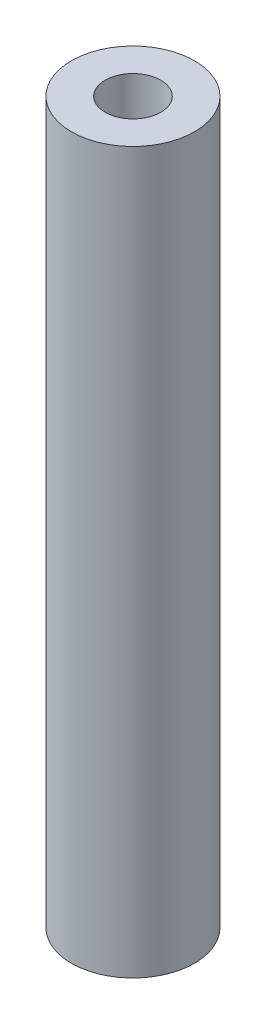
ISO-10303-21;
HEADER;
FILE_DESCRIPTION(('STEP AP214'),'2;1');
FILE_NAME('part.step','',(''),(''),'','','');
FILE_SCHEMA(('AUTOMOTIVE_DESIGN { 1 0 10303 214 1 1 1 1 }'));
ENDSEC;
DATA;
#1=APPLICATION_CONTEXT('core data for automotive mechanical design processes');
#2=APPLICATION_PROTOCOL_DEFINITION('international standard','automotive_design',2000,#1);
#3=PRODUCT_CONTEXT('',#1,'mechanical');
#4=PRODUCT('Part','Part','',(#3));
#5=PRODUCT_RELATED_PRODUCT_CATEGORY('part','',(#4));
#6=PRODUCT_DEFINITION_FORMATION('','',#4);
#7=PRODUCT_DEFINITION_CONTEXT('part definition',#1,'design');
#8=PRODUCT_DEFINITION('design','',#6,#7);
#9=PRODUCT_DEFINITION_SHAPE('','',#8);
#10=(LENGTH_UNIT() NAMED_UNIT(*) SI_UNIT(.MILLI.,.METRE.));
#11=(NAMED_UNIT(*) PLANE_ANGLE_UNIT() SI_UNIT($,.RADIAN.));
#12=(NAMED_UNIT(*) SI_UNIT($,.STERADIAN.) SOLID_ANGLE_UNIT());
#13=UNCERTAINTY_MEASURE_WITH_UNIT(LENGTH_MEASURE(1.E-05),#10,'distance_accuracy_value','');
#14=(GEOMETRIC_REPRESENTATION_CONTEXT(3) GLOBAL_UNCERTAINTY_ASSIGNED_CONTEXT((#13)) GLOBAL_UNIT_ASSIGNED_CONTEXT((#10,
#11,#12)) REPRESENTATION_CONTEXT('',''));
#15=CARTESIAN_POINT('',(0.,0.,0.));
#16=DIRECTION('',(0.,0.,1.));
#17=DIRECTION('',(1.,0.,0.));
#18=AXIS2_PLACEMENT_3D('',#15,#16,#17);
#19=CARTESIAN_POINT('',(0.,55.7276,0.));
#20=DIRECTION('',(0.,1.,0.));
#21=DIRECTION('',(0.,0.,1.));
#22=AXIS2_PLACEMENT_3D('',#19,#20,#21);
#23=PLANE('',#22);
#24=CARTESIAN_POINT('',(0.,55.7276,0.));
#25=DIRECTION('',(0.,1.,0.));
#26=DIRECTION('',(0.,0.,1.));
#27=AXIS2_PLACEMENT_3D('',#24,#25,#26);
#28=CIRCLE('',#27,4.7625);
#29=CARTESIAN_POINT('',(0.,55.7276,4.7625));
#30=VERTEX_POINT('',#29);
#31=EDGE_CURVE('E10',#30,#30,#28,.T.);
#32=ORIENTED_EDGE('',*,*,#31,.T.);
#33=EDGE_LOOP('',(#32));
#34=FACE_BOUND('',#33,.T.);
#35=CARTESIAN_POINT('',(0.,55.7276,0.));
#36=DIRECTION('',(0.,1.,0.));
#37=DIRECTION('',(0.,0.,1.));
#38=AXIS2_PLACEMENT_3D('',#35,#36,#37);
#39=CIRCLE('',#38,2.15265);
#40=CARTESIAN_POINT('',(0.,55.7276,2.15265));
#41=VERTEX_POINT('',#40);
#42=EDGE_CURVE('E42',#41,#41,#39,.T.);
#43=ORIENTED_EDGE('',*,*,#42,.F.);
#44=EDGE_LOOP('',(#43));
#45=FACE_BOUND('',#44,.T.);
#46=ADVANCED_FACE('F31',(#34,#45),#23,.T.);
#47=CARTESIAN_POINT('',(0.,0.,0.));
#48=DIRECTION('',(0.,1.,0.));
#49=DIRECTION('',(0.,0.,1.));
#50=AXIS2_PLACEMENT_3D('',#47,#48,#49);
#51=PLANE('',#50);
#52=CARTESIAN_POINT('',(0.,0.,0.));
#53=DIRECTION('',(0.,1.,0.));
#54=DIRECTION('',(0.,0.,1.));
#55=AXIS2_PLACEMENT_3D('',#52,#53,#54);
#56=CIRCLE('',#55,4.7625);
#57=CARTESIAN_POINT('',(0.,0.,4.7625));
#58=VERTEX_POINT('',#57);
#59=EDGE_CURVE('E35',#58,#58,#56,.T.);
#60=ORIENTED_EDGE('',*,*,#59,.F.);
#61=EDGE_LOOP('',(#60));
#62=FACE_BOUND('',#61,.T.);
#63=CARTESIAN_POINT('',(0.,0.,0.));
#64=DIRECTION('',(0.,1.,0.));
#65=DIRECTION('',(0.,0.,1.));
#66=AXIS2_PLACEMENT_3D('',#63,#64,#65);
#67=CIRCLE('',#66,2.15265);
#68=CARTESIAN_POINT('',(0.,0.,2.15265));
#69=VERTEX_POINT('',#68);
#70=EDGE_CURVE('E44',#69,#69,#67,.T.);
#71=ORIENTED_EDGE('',*,*,#70,.T.);
#72=EDGE_LOOP('',(#71));
#73=FACE_BOUND('',#72,.T.);
#74=ADVANCED_FACE('F54',(#62,#73),#51,.F.);
#75=CARTESIAN_POINT('',(0.,55.7276,0.));
#76=DIRECTION('',(0.,-1.,0.));
#77=DIRECTION('',(0.,0.,-1.));
#78=AXIS2_PLACEMENT_3D('',#75,#76,#77);
#79=CYLINDRICAL_SURFACE('',#78,4.7625);
#80=ORIENTED_EDGE('',*,*,#31,.F.);
#81=EDGE_LOOP('',(#80));
#82=FACE_BOUND('',#81,.T.);
#83=ORIENTED_EDGE('',*,*,#59,.T.);
#84=EDGE_LOOP('',(#83));
#85=FACE_BOUND('',#84,.T.);
#86=ADVANCED_FACE('F33',(#82,#85),#79,.T.);
#87=CARTESIAN_POINT('',(0.,55.7276,0.));
#88=DIRECTION('',(0.,-1.,0.));
#89=DIRECTION('',(0.,0.,-1.));
#90=AXIS2_PLACEMENT_3D('',#87,#88,#89);
#91=CYLINDRICAL_SURFACE('',#90,2.15265);
#92=ORIENTED_EDGE('',*,*,#42,.T.);
#93=EDGE_LOOP('',(#92));
#94=FACE_BOUND('',#93,.T.);
#95=ORIENTED_EDGE('',*,*,#70,.F.);
#96=EDGE_LOOP('',(#95));
#97=FACE_BOUND('',#96,.T.);
#98=ADVANCED_FACE('F50',(#94,#97),#91,.F.);
#99=CLOSED_SHELL('',(#46,#74,#86,#98));
#100=MANIFOLD_SOLID_BREP('B2',#99);
#101=ADVANCED_BREP_SHAPE_REPRESENTATION('',(#18,#100),#14);
#102=SHAPE_DEFINITION_REPRESENTATION(#9,#101);
ENDSEC;
END-ISO-10303-21;
